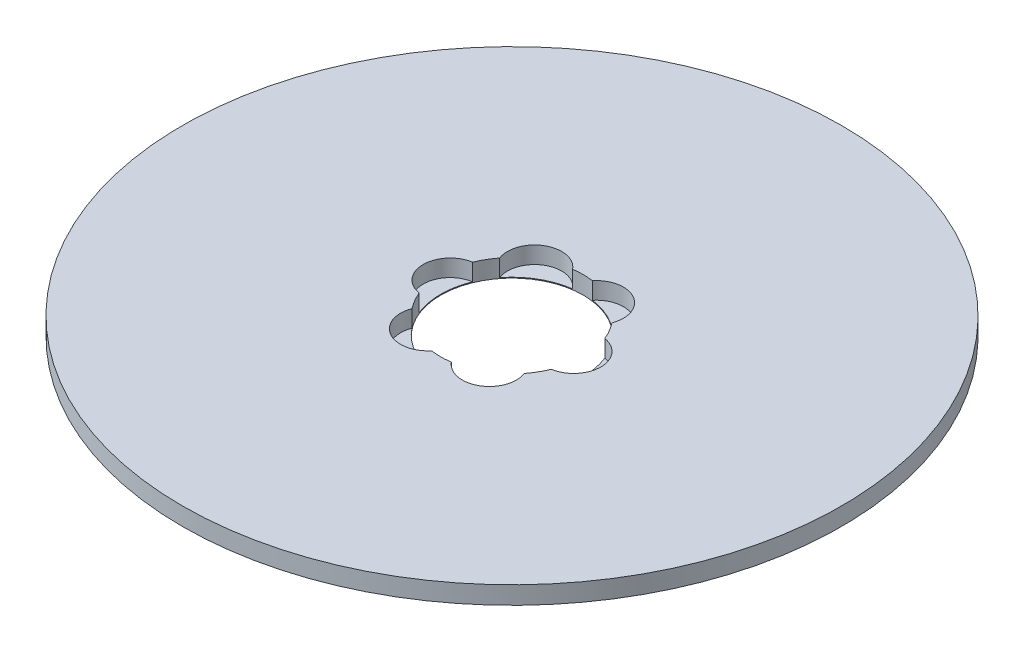
ISO-10303-21;
HEADER;
FILE_DESCRIPTION(('STEP AP214'),'2;1');
FILE_NAME('part.step','',(''),(''),'','','');
FILE_SCHEMA(('AUTOMOTIVE_DESIGN { 1 0 10303 214 1 1 1 1 }'));
ENDSEC;
DATA;
#1=APPLICATION_CONTEXT('core data for automotive mechanical design processes');
#2=APPLICATION_PROTOCOL_DEFINITION('international standard','automotive_design',2000,#1);
#3=PRODUCT_CONTEXT('',#1,'mechanical');
#4=PRODUCT('Part','Part','',(#3));
#5=PRODUCT_RELATED_PRODUCT_CATEGORY('part','',(#4));
#6=PRODUCT_DEFINITION_FORMATION('','',#4);
#7=PRODUCT_DEFINITION_CONTEXT('part definition',#1,'design');
#8=PRODUCT_DEFINITION('design','',#6,#7);
#9=PRODUCT_DEFINITION_SHAPE('','',#8);
#10=(LENGTH_UNIT() NAMED_UNIT(*) SI_UNIT(.MILLI.,.METRE.));
#11=(NAMED_UNIT(*) PLANE_ANGLE_UNIT() SI_UNIT($,.RADIAN.));
#12=(NAMED_UNIT(*) SI_UNIT($,.STERADIAN.) SOLID_ANGLE_UNIT());
#13=UNCERTAINTY_MEASURE_WITH_UNIT(LENGTH_MEASURE(1.E-05),#10,'distance_accuracy_value','');
#14=(GEOMETRIC_REPRESENTATION_CONTEXT(3) GLOBAL_UNCERTAINTY_ASSIGNED_CONTEXT((#13)) GLOBAL_UNIT_ASSIGNED_CONTEXT((#10,
#11,#12)) REPRESENTATION_CONTEXT('',''));
#15=CARTESIAN_POINT('',(0.,0.,0.));
#16=DIRECTION('',(0.,0.,1.));
#17=DIRECTION('',(1.,0.,0.));
#18=AXIS2_PLACEMENT_3D('',#15,#16,#17);
#19=CARTESIAN_POINT('',(0.,5.,0.));
#20=DIRECTION('',(0.,-1.,0.));
#21=DIRECTION('',(0.,0.,-1.));
#22=AXIS2_PLACEMENT_3D('',#19,#20,#21);
#23=CYLINDRICAL_SURFACE('',#22,92.5);
#24=CARTESIAN_POINT('',(0.,5.,0.));
#25=DIRECTION('',(0.,1.,0.));
#26=DIRECTION('',(0.,0.,1.));
#27=AXIS2_PLACEMENT_3D('',#24,#25,#26);
#28=CIRCLE('',#27,92.5);
#29=CARTESIAN_POINT('',(0.,5.,92.5));
#30=VERTEX_POINT('',#29);
#31=EDGE_CURVE('E165',#30,#30,#28,.T.);
#32=ORIENTED_EDGE('',*,*,#31,.F.);
#33=EDGE_LOOP('',(#32));
#34=FACE_BOUND('',#33,.T.);
#35=CARTESIAN_POINT('',(0.,0.,0.));
#36=DIRECTION('',(0.,1.,0.));
#37=DIRECTION('',(0.,0.,1.));
#38=AXIS2_PLACEMENT_3D('',#35,#36,#37);
#39=CIRCLE('',#38,92.5);
#40=CARTESIAN_POINT('',(0.,0.,92.5));
#41=VERTEX_POINT('',#40);
#42=EDGE_CURVE('E158',#41,#41,#39,.T.);
#43=ORIENTED_EDGE('',*,*,#42,.T.);
#44=EDGE_LOOP('',(#43));
#45=FACE_BOUND('',#44,.T.);
#46=ADVANCED_FACE('F39',(#34,#45),#23,.T.);
#47=CARTESIAN_POINT('',(0.,5.,0.));
#48=DIRECTION('',(0.,1.,0.));
#49=DIRECTION('',(0.,0.,1.));
#50=AXIS2_PLACEMENT_3D('',#47,#48,#49);
#51=PLANE('',#50);
#52=CARTESIAN_POINT('',(17.3302579547913,5.,0.));
#53=DIRECTION('',(0.,1.,0.));
#54=DIRECTION('',(0.,0.,-1.));
#55=AXIS2_PLACEMENT_3D('',#52,#53,#54);
#56=CIRCLE('',#55,7.59614940019468);
#57=CARTESIAN_POINT('',(18.5408767932349,5.,7.49905912352233));
#58=VERTEX_POINT('',#57);
#59=CARTESIAN_POINT('',(18.5408767932349,5.,-7.49905912352233));
#60=VERTEX_POINT('',#59);
#61=EDGE_CURVE('E218',#58,#60,#56,.T.);
#62=ORIENTED_EDGE('',*,*,#61,.F.);
#63=CARTESIAN_POINT('',(0.,5.,0.));
#64=DIRECTION('',(0.,1.,0.));
#65=DIRECTION('',(0.,0.,1.));
#66=AXIS2_PLACEMENT_3D('',#63,#64,#65);
#67=CIRCLE('',#66,20.);
#68=CARTESIAN_POINT('',(15.7648141020693,5.,12.3073407496175));
#69=VERTEX_POINT('',#68);
#70=EDGE_CURVE('E163',#69,#58,#67,.T.);
#71=ORIENTED_EDGE('',*,*,#70,.F.);
#72=CARTESIAN_POINT('',(8.66512897739574,5.,15.0084436429866));
#73=DIRECTION('',(0.,1.,0.));
#74=DIRECTION('',(0.866025403784436,0.,-0.500000000000004));
#75=AXIS2_PLACEMENT_3D('',#72,#73,#74);
#76=CIRCLE('',#75,7.59614940019468);
#77=CARTESIAN_POINT('',(2.77606269116573,5.,19.8063998731399));
#78=VERTEX_POINT('',#77);
#79=EDGE_CURVE('E391',#78,#69,#76,.T.);
#80=ORIENTED_EDGE('',*,*,#79,.F.);
#81=CARTESIAN_POINT('',(-2.7760626911656,5.,19.80639987314));
#82=VERTEX_POINT('',#81);
#83=EDGE_CURVE('E149',#82,#78,#67,.T.);
#84=ORIENTED_EDGE('',*,*,#83,.F.);
#85=CARTESIAN_POINT('',(-8.66512897739563,5.,15.0084436429867));
#86=DIRECTION('',(0.,1.,0.));
#87=DIRECTION('',(0.86602540378444,0.,0.499999999999998));
#88=AXIS2_PLACEMENT_3D('',#85,#86,#87);
#89=CIRCLE('',#88,7.59614940019468);
#90=CARTESIAN_POINT('',(-15.7648141020692,5.,12.3073407496177));
#91=VERTEX_POINT('',#90);
#92=EDGE_CURVE('E128',#91,#82,#89,.T.);
#93=ORIENTED_EDGE('',*,*,#92,.F.);
#94=CARTESIAN_POINT('',(-18.5408767932349,5.,7.49905912352233));
#95=VERTEX_POINT('',#94);
#96=EDGE_CURVE('E148',#95,#91,#67,.T.);
#97=ORIENTED_EDGE('',*,*,#96,.F.);
#98=CARTESIAN_POINT('',(-17.3302579547913,5.,0.));
#99=DIRECTION('',(0.,1.,0.));
#100=DIRECTION('',(0.,0.,1.));
#101=AXIS2_PLACEMENT_3D('',#98,#99,#100);
#102=CIRCLE('',#101,7.59614940019468);
#103=CARTESIAN_POINT('',(-18.5408767932349,5.,-7.49905912352233));
#104=VERTEX_POINT('',#103);
#105=EDGE_CURVE('E178',#104,#95,#102,.T.);
#106=ORIENTED_EDGE('',*,*,#105,.F.);
#107=CARTESIAN_POINT('',(-15.7648141020694,5.,-12.3073407496174));
#108=VERTEX_POINT('',#107);
#109=EDGE_CURVE('E159',#108,#104,#67,.T.);
#110=ORIENTED_EDGE('',*,*,#109,.F.);
#111=CARTESIAN_POINT('',(-8.66512897739584,5.,-15.0084436429865));
#112=DIRECTION('',(0.,1.,0.));
#113=DIRECTION('',(-0.866025403784433,0.,0.50000000000001));
#114=AXIS2_PLACEMENT_3D('',#111,#112,#113);
#115=CIRCLE('',#114,7.59614940019468);
#116=CARTESIAN_POINT('',(-2.77606269116588,5.,-19.8063998731399));
#117=VERTEX_POINT('',#116);
#118=EDGE_CURVE('E376',#117,#108,#115,.T.);
#119=ORIENTED_EDGE('',*,*,#118,.F.);
#120=CARTESIAN_POINT('',(2.77606269116546,5.,-19.80639987314));
#121=VERTEX_POINT('',#120);
#122=EDGE_CURVE('E170',#121,#117,#67,.T.);
#123=ORIENTED_EDGE('',*,*,#122,.F.);
#124=CARTESIAN_POINT('',(8.66512897739553,5.,-15.0084436429867));
#125=DIRECTION('',(0.,1.,0.));
#126=DIRECTION('',(-0.866025403784443,0.,-0.499999999999992));
#127=AXIS2_PLACEMENT_3D('',#124,#125,#126);
#128=CIRCLE('',#127,7.59614940019468);
#129=CARTESIAN_POINT('',(15.7648141020691,5.,-12.3073407496178));
#130=VERTEX_POINT('',#129);
#131=EDGE_CURVE('E384',#130,#121,#128,.T.);
#132=ORIENTED_EDGE('',*,*,#131,.F.);
#133=EDGE_CURVE('E173',#60,#130,#67,.T.);
#134=ORIENTED_EDGE('',*,*,#133,.F.);
#135=EDGE_LOOP('',(#62,#71,#80,#84,#93,#97,#106,#110,#119,#123,#132,#134));
#136=FACE_BOUND('',#135,.T.);
#137=ORIENTED_EDGE('',*,*,#31,.T.);
#138=EDGE_LOOP('',(#137));
#139=FACE_BOUND('',#138,.T.);
#140=ADVANCED_FACE('F141',(#136,#139),#51,.T.);
#141=CARTESIAN_POINT('',(0.,0.,0.));
#142=DIRECTION('',(0.,1.,0.));
#143=DIRECTION('',(0.,0.,1.));
#144=AXIS2_PLACEMENT_3D('',#141,#142,#143);
#145=PLANE('',#144);
#146=CARTESIAN_POINT('',(0.,0.,0.));
#147=DIRECTION('',(0.,1.,0.));
#148=DIRECTION('',(0.,0.,1.));
#149=AXIS2_PLACEMENT_3D('',#146,#147,#148);
#150=CIRCLE('',#149,20.);
#151=CARTESIAN_POINT('',(0.,0.,20.));
#152=VERTEX_POINT('',#151);
#153=EDGE_CURVE('E169',#152,#152,#150,.T.);
#154=ORIENTED_EDGE('',*,*,#153,.T.);
#155=EDGE_LOOP('',(#154));
#156=FACE_BOUND('',#155,.T.);
#157=ORIENTED_EDGE('',*,*,#42,.F.);
#158=EDGE_LOOP('',(#157));
#159=FACE_BOUND('',#158,.T.);
#160=ADVANCED_FACE('F236',(#156,#159),#145,.F.);
#161=CARTESIAN_POINT('',(0.,5.,0.));
#162=DIRECTION('',(0.,-1.,0.));
#163=DIRECTION('',(0.,0.,-1.));
#164=AXIS2_PLACEMENT_3D('',#161,#162,#163);
#165=CYLINDRICAL_SURFACE('',#164,20.);
#166=DIRECTION('',(0.,1.,0.));
#167=VECTOR('',#166,1.);
#168=CARTESIAN_POINT('',(18.5408767932349,2.61503285114553,7.49905912352233));
#169=LINE('',#168,#167);
#170=CARTESIAN_POINT('',(18.5408767932349,0.230065702291066,7.49905912352233));
#171=VERTEX_POINT('',#170);
#172=EDGE_CURVE('E11',#171,#58,#169,.T.);
#173=ORIENTED_EDGE('',*,*,#172,.F.);
#174=CARTESIAN_POINT('',(0.,0.230065702291066,0.));
#175=DIRECTION('',(0.,1.,0.));
#176=DIRECTION('',(0.,0.,1.));
#177=AXIS2_PLACEMENT_3D('',#174,#175,#176);
#178=CIRCLE('',#177,20.);
#179=CARTESIAN_POINT('',(18.5408767932349,0.230065702291066,-7.49905912352233));
#180=VERTEX_POINT('',#179);
#181=EDGE_CURVE('E212',#171,#180,#178,.T.);
#182=ORIENTED_EDGE('',*,*,#181,.T.);
#183=DIRECTION('',(0.,1.,0.));
#184=VECTOR('',#183,1.);
#185=CARTESIAN_POINT('',(18.5408767932349,2.61503285114553,-7.49905912352233));
#186=LINE('',#185,#184);
#187=EDGE_CURVE('E46',#60,#180,#186,.F.);
#188=ORIENTED_EDGE('',*,*,#187,.F.);
#189=ORIENTED_EDGE('',*,*,#133,.T.);
#190=DIRECTION('',(0.,1.,0.));
#191=VECTOR('',#190,1.);
#192=CARTESIAN_POINT('',(15.7648141020691,2.61503285114553,-12.3073407496178));
#193=LINE('',#192,#191);
#194=CARTESIAN_POINT('',(15.7648141020691,0.230065702291066,-12.3073407496178));
#195=VERTEX_POINT('',#194);
#196=EDGE_CURVE('E202',#195,#130,#193,.T.);
#197=ORIENTED_EDGE('',*,*,#196,.F.);
#198=CARTESIAN_POINT('',(0.,0.230065702291066,0.));
#199=DIRECTION('',(0.,1.,0.));
#200=DIRECTION('',(0.,0.,1.));
#201=AXIS2_PLACEMENT_3D('',#198,#199,#200);
#202=CIRCLE('',#201,20.);
#203=CARTESIAN_POINT('',(2.77606269116546,0.230065702291066,-19.80639987314));
#204=VERTEX_POINT('',#203);
#205=EDGE_CURVE('E200',#195,#204,#202,.T.);
#206=ORIENTED_EDGE('',*,*,#205,.T.);
#207=DIRECTION('',(0.,1.,0.));
#208=VECTOR('',#207,1.);
#209=CARTESIAN_POINT('',(2.77606269116546,2.61503285114553,-19.80639987314));
#210=LINE('',#209,#208);
#211=EDGE_CURVE('E205',#121,#204,#210,.F.);
#212=ORIENTED_EDGE('',*,*,#211,.F.);
#213=ORIENTED_EDGE('',*,*,#122,.T.);
#214=DIRECTION('',(0.,1.,0.));
#215=VECTOR('',#214,1.);
#216=CARTESIAN_POINT('',(-2.77606269116587,2.61503285114553,-19.8063998731399));
#217=LINE('',#216,#215);
#218=CARTESIAN_POINT('',(-2.77606269116588,0.230065702291066,-19.8063998731399));
#219=VERTEX_POINT('',#218);
#220=EDGE_CURVE('E197',#219,#117,#217,.T.);
#221=ORIENTED_EDGE('',*,*,#220,.F.);
#222=CARTESIAN_POINT('',(0.,0.230065702291066,0.));
#223=DIRECTION('',(0.,1.,0.));
#224=DIRECTION('',(0.,0.,1.));
#225=AXIS2_PLACEMENT_3D('',#222,#223,#224);
#226=CIRCLE('',#225,20.);
#227=CARTESIAN_POINT('',(-15.7648141020694,0.230065702291066,-12.3073407496174));
#228=VERTEX_POINT('',#227);
#229=EDGE_CURVE('E136',#219,#228,#226,.T.);
#230=ORIENTED_EDGE('',*,*,#229,.T.);
#231=DIRECTION('',(0.,1.,0.));
#232=VECTOR('',#231,1.);
#233=CARTESIAN_POINT('',(-15.7648141020694,2.61503285114553,-12.3073407496174));
#234=LINE('',#233,#232);
#235=EDGE_CURVE('E193',#108,#228,#234,.F.);
#236=ORIENTED_EDGE('',*,*,#235,.F.);
#237=ORIENTED_EDGE('',*,*,#109,.T.);
#238=DIRECTION('',(0.,1.,0.));
#239=VECTOR('',#238,1.);
#240=CARTESIAN_POINT('',(-18.5408767932349,2.61503285114553,-7.49905912352233));
#241=LINE('',#240,#239);
#242=CARTESIAN_POINT('',(-18.5408767932349,0.230065702291066,-7.49905912352233));
#243=VERTEX_POINT('',#242);
#244=EDGE_CURVE('E190',#243,#104,#241,.T.);
#245=ORIENTED_EDGE('',*,*,#244,.F.);
#246=CARTESIAN_POINT('',(0.,0.230065702291066,0.));
#247=DIRECTION('',(0.,1.,0.));
#248=DIRECTION('',(0.,0.,1.));
#249=AXIS2_PLACEMENT_3D('',#246,#247,#248);
#250=CIRCLE('',#249,20.);
#251=CARTESIAN_POINT('',(-18.5408767932349,0.230065702291066,7.49905912352233));
#252=VERTEX_POINT('',#251);
#253=EDGE_CURVE('E181',#243,#252,#250,.T.);
#254=ORIENTED_EDGE('',*,*,#253,.T.);
#255=DIRECTION('',(0.,1.,0.));
#256=VECTOR('',#255,1.);
#257=CARTESIAN_POINT('',(-18.5408767932349,2.61503285114553,7.49905912352233));
#258=LINE('',#257,#256);
#259=EDGE_CURVE('E160',#95,#252,#258,.F.);
#260=ORIENTED_EDGE('',*,*,#259,.F.);
#261=ORIENTED_EDGE('',*,*,#96,.T.);
#262=DIRECTION('',(0.,1.,0.));
#263=VECTOR('',#262,1.);
#264=CARTESIAN_POINT('',(-15.7648141020692,2.61503285114553,12.3073407496177));
#265=LINE('',#264,#263);
#266=CARTESIAN_POINT('',(-15.7648141020692,0.230065702291066,12.3073407496177));
#267=VERTEX_POINT('',#266);
#268=EDGE_CURVE('E127',#267,#91,#265,.T.);
#269=ORIENTED_EDGE('',*,*,#268,.F.);
#270=CARTESIAN_POINT('',(0.,0.230065702291066,0.));
#271=DIRECTION('',(0.,1.,0.));
#272=DIRECTION('',(0.,0.,1.));
#273=AXIS2_PLACEMENT_3D('',#270,#271,#272);
#274=CIRCLE('',#273,20.);
#275=CARTESIAN_POINT('',(-2.7760626911656,0.230065702291066,19.80639987314));
#276=VERTEX_POINT('',#275);
#277=EDGE_CURVE('E188',#267,#276,#274,.T.);
#278=ORIENTED_EDGE('',*,*,#277,.T.);
#279=DIRECTION('',(0.,1.,0.));
#280=VECTOR('',#279,1.);
#281=CARTESIAN_POINT('',(-2.7760626911656,2.61503285114553,19.80639987314));
#282=LINE('',#281,#280);
#283=EDGE_CURVE('E140',#82,#276,#282,.F.);
#284=ORIENTED_EDGE('',*,*,#283,.F.);
#285=ORIENTED_EDGE('',*,*,#83,.T.);
#286=DIRECTION('',(0.,1.,0.));
#287=VECTOR('',#286,1.);
#288=CARTESIAN_POINT('',(2.77606269116574,2.61503285114553,19.8063998731399));
#289=LINE('',#288,#287);
#290=CARTESIAN_POINT('',(2.77606269116573,0.230065702291066,19.8063998731399));
#291=VERTEX_POINT('',#290);
#292=EDGE_CURVE('E215',#291,#78,#289,.T.);
#293=ORIENTED_EDGE('',*,*,#292,.F.);
#294=CARTESIAN_POINT('',(0.,0.230065702291066,0.));
#295=DIRECTION('',(0.,1.,0.));
#296=DIRECTION('',(0.,0.,1.));
#297=AXIS2_PLACEMENT_3D('',#294,#295,#296);
#298=CIRCLE('',#297,20.);
#299=CARTESIAN_POINT('',(15.7648141020693,0.230065702291066,12.3073407496175));
#300=VERTEX_POINT('',#299);
#301=EDGE_CURVE('E210',#291,#300,#298,.T.);
#302=ORIENTED_EDGE('',*,*,#301,.T.);
#303=DIRECTION('',(0.,1.,0.));
#304=VECTOR('',#303,1.);
#305=CARTESIAN_POINT('',(15.7648141020693,2.61503285114553,12.3073407496175));
#306=LINE('',#305,#304);
#307=EDGE_CURVE('E209',#69,#300,#306,.F.);
#308=ORIENTED_EDGE('',*,*,#307,.F.);
#309=ORIENTED_EDGE('',*,*,#70,.T.);
#310=EDGE_LOOP('',(#173,#182,#188,#189,#197,#206,#212,#213,#221,#230,#236,#237,#245,#254,#260,
#261,#269,#278,#284,#285,#293,#302,#308,#309));
#311=FACE_BOUND('',#310,.T.);
#312=ORIENTED_EDGE('',*,*,#153,.F.);
#313=EDGE_LOOP('',(#312));
#314=FACE_BOUND('',#313,.T.);
#315=ADVANCED_FACE('F153',(#311,#314),#165,.F.);
#316=CARTESIAN_POINT('',(-17.3302579547913,0.230065702291066,0.));
#317=DIRECTION('',(0.,1.,0.));
#318=DIRECTION('',(0.,0.,1.));
#319=AXIS2_PLACEMENT_3D('',#316,#317,#318);
#320=CYLINDRICAL_SURFACE('',#319,7.59614940019468);
#321=ORIENTED_EDGE('',*,*,#244,.T.);
#322=ORIENTED_EDGE('',*,*,#105,.T.);
#323=ORIENTED_EDGE('',*,*,#259,.T.);
#324=CARTESIAN_POINT('',(-17.3302579547913,0.230065702291066,0.));
#325=DIRECTION('',(0.,1.,0.));
#326=DIRECTION('',(0.,0.,1.));
#327=AXIS2_PLACEMENT_3D('',#324,#325,#326);
#328=CIRCLE('',#327,7.59614940019468);
#329=EDGE_CURVE('E176',#243,#252,#328,.T.);
#330=ORIENTED_EDGE('',*,*,#329,.F.);
#331=EDGE_LOOP('',(#321,#322,#323,#330));
#332=FACE_BOUND('',#331,.T.);
#333=ADVANCED_FACE('F247',(#332),#320,.F.);
#334=CARTESIAN_POINT('',(-17.3302579547913,0.230065702291066,0.));
#335=DIRECTION('',(0.,1.,0.));
#336=DIRECTION('',(0.,0.,1.));
#337=AXIS2_PLACEMENT_3D('',#334,#335,#336);
#338=PLANE('',#337);
#339=ORIENTED_EDGE('',*,*,#329,.T.);
#340=ORIENTED_EDGE('',*,*,#253,.F.);
#341=EDGE_LOOP('',(#339,#340));
#342=FACE_BOUND('',#341,.T.);
#343=ADVANCED_FACE('F252',(#342),#338,.T.);
#344=CARTESIAN_POINT('',(-8.66512897739563,0.230065702291066,15.0084436429867));
#345=DIRECTION('',(0.,1.,0.));
#346=DIRECTION('',(0.,0.,1.));
#347=AXIS2_PLACEMENT_3D('',#344,#345,#346);
#348=CYLINDRICAL_SURFACE('',#347,7.59614940019468);
#349=ORIENTED_EDGE('',*,*,#268,.T.);
#350=ORIENTED_EDGE('',*,*,#92,.T.);
#351=ORIENTED_EDGE('',*,*,#283,.T.);
#352=CARTESIAN_POINT('',(-8.66512897739563,0.230065702291066,15.0084436429867));
#353=DIRECTION('',(0.,1.,0.));
#354=DIRECTION('',(0.86602540378444,0.,0.499999999999998));
#355=AXIS2_PLACEMENT_3D('',#352,#353,#354);
#356=CIRCLE('',#355,7.59614940019468);
#357=EDGE_CURVE('E135',#267,#276,#356,.T.);
#358=ORIENTED_EDGE('',*,*,#357,.F.);
#359=EDGE_LOOP('',(#349,#350,#351,#358));
#360=FACE_BOUND('',#359,.T.);
#361=ADVANCED_FACE('F126',(#360),#348,.F.);
#362=CARTESIAN_POINT('',(-8.66512897739563,0.230065702291066,15.0084436429867));
#363=DIRECTION('',(0.,1.,0.));
#364=DIRECTION('',(0.86602540378444,0.,0.499999999999998));
#365=AXIS2_PLACEMENT_3D('',#362,#363,#364);
#366=PLANE('',#365);
#367=ORIENTED_EDGE('',*,*,#357,.T.);
#368=ORIENTED_EDGE('',*,*,#277,.F.);
#369=EDGE_LOOP('',(#367,#368));
#370=FACE_BOUND('',#369,.T.);
#371=ADVANCED_FACE('F259',(#370),#366,.T.);
#372=CARTESIAN_POINT('',(-8.66512897739584,0.230065702291066,-15.0084436429865));
#373=DIRECTION('',(0.,1.,0.));
#374=DIRECTION('',(0.,0.,1.));
#375=AXIS2_PLACEMENT_3D('',#372,#373,#374);
#376=CYLINDRICAL_SURFACE('',#375,7.59614940019468);
#377=ORIENTED_EDGE('',*,*,#220,.T.);
#378=ORIENTED_EDGE('',*,*,#118,.T.);
#379=ORIENTED_EDGE('',*,*,#235,.T.);
#380=CARTESIAN_POINT('',(-8.66512897739584,0.230065702291066,-15.0084436429865));
#381=DIRECTION('',(0.,1.,0.));
#382=DIRECTION('',(-0.866025403784433,0.,0.50000000000001));
#383=AXIS2_PLACEMENT_3D('',#380,#381,#382);
#384=CIRCLE('',#383,7.59614940019468);
#385=EDGE_CURVE('E380',#219,#228,#384,.T.);
#386=ORIENTED_EDGE('',*,*,#385,.F.);
#387=EDGE_LOOP('',(#377,#378,#379,#386));
#388=FACE_BOUND('',#387,.T.);
#389=ADVANCED_FACE('F265',(#388),#376,.F.);
#390=CARTESIAN_POINT('',(-8.66512897739584,0.230065702291066,-15.0084436429865));
#391=DIRECTION('',(0.,1.,0.));
#392=DIRECTION('',(-0.866025403784433,0.,0.50000000000001));
#393=AXIS2_PLACEMENT_3D('',#390,#391,#392);
#394=PLANE('',#393);
#395=ORIENTED_EDGE('',*,*,#385,.T.);
#396=ORIENTED_EDGE('',*,*,#229,.F.);
#397=EDGE_LOOP('',(#395,#396));
#398=FACE_BOUND('',#397,.T.);
#399=ADVANCED_FACE('F308',(#398),#394,.T.);
#400=CARTESIAN_POINT('',(8.66512897739553,0.230065702291066,-15.0084436429867));
#401=DIRECTION('',(0.,1.,0.));
#402=DIRECTION('',(0.,0.,1.));
#403=AXIS2_PLACEMENT_3D('',#400,#401,#402);
#404=CYLINDRICAL_SURFACE('',#403,7.59614940019468);
#405=ORIENTED_EDGE('',*,*,#196,.T.);
#406=ORIENTED_EDGE('',*,*,#131,.T.);
#407=ORIENTED_EDGE('',*,*,#211,.T.);
#408=CARTESIAN_POINT('',(8.66512897739553,0.230065702291066,-15.0084436429867));
#409=DIRECTION('',(0.,1.,0.));
#410=DIRECTION('',(-0.866025403784443,0.,-0.499999999999992));
#411=AXIS2_PLACEMENT_3D('',#408,#409,#410);
#412=CIRCLE('',#411,7.59614940019468);
#413=EDGE_CURVE('E383',#195,#204,#412,.T.);
#414=ORIENTED_EDGE('',*,*,#413,.F.);
#415=EDGE_LOOP('',(#405,#406,#407,#414));
#416=FACE_BOUND('',#415,.T.);
#417=ADVANCED_FACE('F300',(#416),#404,.F.);
#418=CARTESIAN_POINT('',(8.66512897739553,0.230065702291066,-15.0084436429867));
#419=DIRECTION('',(0.,1.,0.));
#420=DIRECTION('',(-0.866025403784443,0.,-0.499999999999992));
#421=AXIS2_PLACEMENT_3D('',#418,#419,#420);
#422=PLANE('',#421);
#423=ORIENTED_EDGE('',*,*,#413,.T.);
#424=ORIENTED_EDGE('',*,*,#205,.F.);
#425=EDGE_LOOP('',(#423,#424));
#426=FACE_BOUND('',#425,.T.);
#427=ADVANCED_FACE('F270',(#426),#422,.T.);
#428=CARTESIAN_POINT('',(8.66512897739574,0.230065702291066,15.0084436429866));
#429=DIRECTION('',(0.,1.,0.));
#430=DIRECTION('',(0.,0.,1.));
#431=AXIS2_PLACEMENT_3D('',#428,#429,#430);
#432=CYLINDRICAL_SURFACE('',#431,7.59614940019468);
#433=ORIENTED_EDGE('',*,*,#292,.T.);
#434=ORIENTED_EDGE('',*,*,#79,.T.);
#435=ORIENTED_EDGE('',*,*,#307,.T.);
#436=CARTESIAN_POINT('',(8.66512897739574,0.230065702291066,15.0084436429866));
#437=DIRECTION('',(0.,1.,0.));
#438=DIRECTION('',(0.866025403784436,0.,-0.500000000000004));
#439=AXIS2_PLACEMENT_3D('',#436,#437,#438);
#440=CIRCLE('',#439,7.59614940019468);
#441=EDGE_CURVE('E56',#291,#300,#440,.T.);
#442=ORIENTED_EDGE('',*,*,#441,.F.);
#443=EDGE_LOOP('',(#433,#434,#435,#442));
#444=FACE_BOUND('',#443,.T.);
#445=ADVANCED_FACE('F262',(#444),#432,.F.);
#446=CARTESIAN_POINT('',(8.66512897739574,0.230065702291066,15.0084436429866));
#447=DIRECTION('',(0.,1.,0.));
#448=DIRECTION('',(0.866025403784436,0.,-0.500000000000004));
#449=AXIS2_PLACEMENT_3D('',#446,#447,#448);
#450=PLANE('',#449);
#451=ORIENTED_EDGE('',*,*,#441,.T.);
#452=ORIENTED_EDGE('',*,*,#301,.F.);
#453=EDGE_LOOP('',(#451,#452));
#454=FACE_BOUND('',#453,.T.);
#455=ADVANCED_FACE('F228',(#454),#450,.T.);
#456=CARTESIAN_POINT('',(17.3302579547913,0.230065702291066,0.));
#457=DIRECTION('',(0.,1.,0.));
#458=DIRECTION('',(0.,0.,1.));
#459=AXIS2_PLACEMENT_3D('',#456,#457,#458);
#460=CYLINDRICAL_SURFACE('',#459,7.59614940019468);
#461=ORIENTED_EDGE('',*,*,#172,.T.);
#462=ORIENTED_EDGE('',*,*,#61,.T.);
#463=ORIENTED_EDGE('',*,*,#187,.T.);
#464=CARTESIAN_POINT('',(17.3302579547913,0.230065702291066,0.));
#465=DIRECTION('',(0.,1.,0.));
#466=DIRECTION('',(0.,0.,-1.));
#467=AXIS2_PLACEMENT_3D('',#464,#465,#466);
#468=CIRCLE('',#467,7.59614940019468);
#469=EDGE_CURVE('E55',#171,#180,#468,.T.);
#470=ORIENTED_EDGE('',*,*,#469,.F.);
#471=EDGE_LOOP('',(#461,#462,#463,#470));
#472=FACE_BOUND('',#471,.T.);
#473=ADVANCED_FACE('F217',(#472),#460,.F.);
#474=CARTESIAN_POINT('',(17.3302579547913,0.230065702291066,0.));
#475=DIRECTION('',(0.,1.,0.));
#476=DIRECTION('',(0.,0.,-1.));
#477=AXIS2_PLACEMENT_3D('',#474,#475,#476);
#478=PLANE('',#477);
#479=ORIENTED_EDGE('',*,*,#469,.T.);
#480=ORIENTED_EDGE('',*,*,#181,.F.);
#481=EDGE_LOOP('',(#479,#480));
#482=FACE_BOUND('',#481,.T.);
#483=ADVANCED_FACE('F224',(#482),#478,.T.);
#484=CLOSED_SHELL('',(#46,#140,#160,#315,#333,#343,#361,#371,#389,#399,#417,#427,#445,#455,#473,#483));
#485=MANIFOLD_SOLID_BREP('B2',#484);
#486=ADVANCED_BREP_SHAPE_REPRESENTATION('',(#18,#485),#14);
#487=SHAPE_DEFINITION_REPRESENTATION(#9,#486);
ENDSEC;
END-ISO-10303-21;
